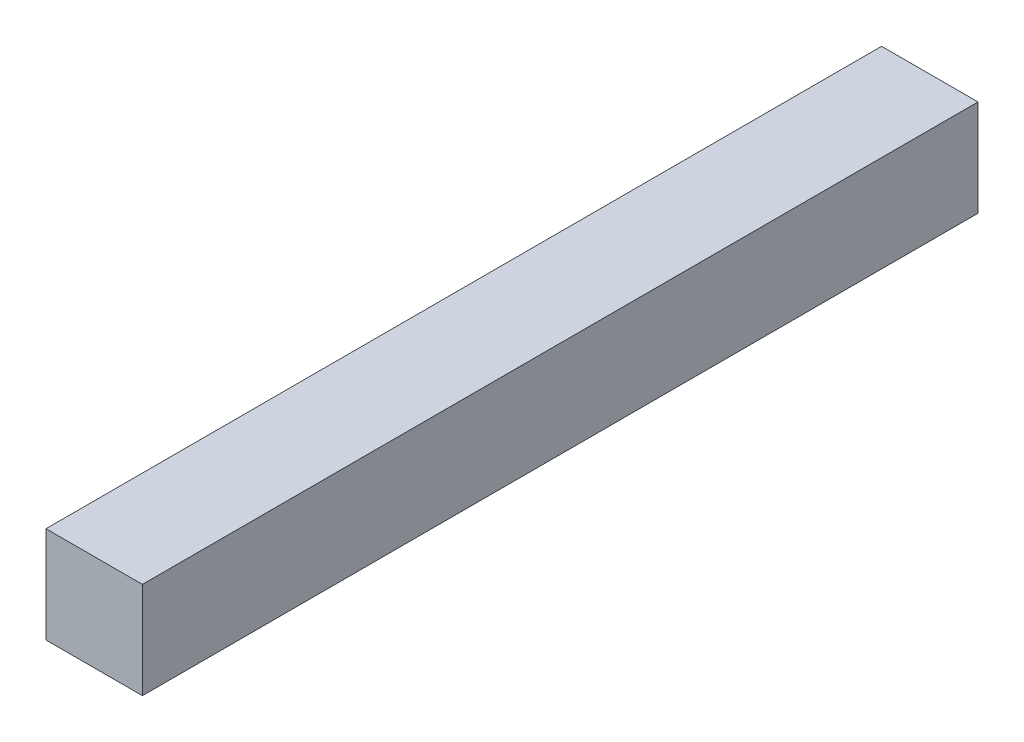
ISO-10303-21;
HEADER;
FILE_DESCRIPTION(('STEP AP214'),'2;1');
FILE_NAME('part.step','',(''),(''),'','','');
FILE_SCHEMA(('AUTOMOTIVE_DESIGN { 1 0 10303 214 1 1 1 1 }'));
ENDSEC;
DATA;
#1=APPLICATION_CONTEXT('core data for automotive mechanical design processes');
#2=APPLICATION_PROTOCOL_DEFINITION('international standard','automotive_design',2000,#1);
#3=PRODUCT_CONTEXT('',#1,'mechanical');
#4=PRODUCT('Part','Part','',(#3));
#5=PRODUCT_RELATED_PRODUCT_CATEGORY('part','',(#4));
#6=PRODUCT_DEFINITION_FORMATION('','',#4);
#7=PRODUCT_DEFINITION_CONTEXT('part definition',#1,'design');
#8=PRODUCT_DEFINITION('design','',#6,#7);
#9=PRODUCT_DEFINITION_SHAPE('','',#8);
#10=(LENGTH_UNIT() NAMED_UNIT(*) SI_UNIT(.MILLI.,.METRE.));
#11=(NAMED_UNIT(*) PLANE_ANGLE_UNIT() SI_UNIT($,.RADIAN.));
#12=(NAMED_UNIT(*) SI_UNIT($,.STERADIAN.) SOLID_ANGLE_UNIT());
#13=UNCERTAINTY_MEASURE_WITH_UNIT(LENGTH_MEASURE(1.E-05),#10,'distance_accuracy_value','');
#14=(GEOMETRIC_REPRESENTATION_CONTEXT(3) GLOBAL_UNCERTAINTY_ASSIGNED_CONTEXT((#13)) GLOBAL_UNIT_ASSIGNED_CONTEXT((#10,
#11,#12)) REPRESENTATION_CONTEXT('',''));
#15=CARTESIAN_POINT('',(0.,0.,0.));
#16=DIRECTION('',(0.,0.,1.));
#17=DIRECTION('',(1.,0.,0.));
#18=AXIS2_PLACEMENT_3D('',#15,#16,#17);
#19=CARTESIAN_POINT('',(-0.75,-0.75,13.));
#20=DIRECTION('',(1.,0.,0.));
#21=DIRECTION('',(0.,0.,-1.));
#22=AXIS2_PLACEMENT_3D('',#19,#20,#21);
#23=PLANE('',#22);
#24=DIRECTION('',(0.,-1.,0.));
#25=VECTOR('',#24,1.);
#26=CARTESIAN_POINT('',(-0.75,-0.75,0.));
#27=LINE('',#26,#25);
#28=CARTESIAN_POINT('',(-0.75,0.75,0.));
#29=VERTEX_POINT('',#28);
#30=CARTESIAN_POINT('',(-0.75,-0.75,0.));
#31=VERTEX_POINT('',#30);
#32=EDGE_CURVE('E96',#29,#31,#27,.T.);
#33=ORIENTED_EDGE('',*,*,#32,.T.);
#34=DIRECTION('',(0.,0.,-1.));
#35=VECTOR('',#34,1.);
#36=CARTESIAN_POINT('',(-0.75,-0.75,13.));
#37=LINE('',#36,#35);
#38=CARTESIAN_POINT('',(-0.75,-0.75,13.));
#39=VERTEX_POINT('',#38);
#40=EDGE_CURVE('E11',#39,#31,#37,.T.);
#41=ORIENTED_EDGE('',*,*,#40,.F.);
#42=DIRECTION('',(0.,-1.,0.));
#43=VECTOR('',#42,1.);
#44=CARTESIAN_POINT('',(-0.75,-0.75,13.));
#45=LINE('',#44,#43);
#46=CARTESIAN_POINT('',(-0.75,0.75,13.));
#47=VERTEX_POINT('',#46);
#48=EDGE_CURVE('E84',#47,#39,#45,.T.);
#49=ORIENTED_EDGE('',*,*,#48,.F.);
#50=DIRECTION('',(0.,0.,-1.));
#51=VECTOR('',#50,1.);
#52=CARTESIAN_POINT('',(-0.75,0.75,13.));
#53=LINE('',#52,#51);
#54=EDGE_CURVE('E92',#47,#29,#53,.T.);
#55=ORIENTED_EDGE('',*,*,#54,.T.);
#56=EDGE_LOOP('',(#33,#41,#49,#55));
#57=FACE_BOUND('',#56,.T.);
#58=ADVANCED_FACE('F33',(#57),#23,.F.);
#59=CARTESIAN_POINT('',(0.75,-0.75,13.));
#60=DIRECTION('',(0.,1.,0.));
#61=DIRECTION('',(-1.,0.,0.));
#62=AXIS2_PLACEMENT_3D('',#59,#60,#61);
#63=PLANE('',#62);
#64=DIRECTION('',(1.,0.,0.));
#65=VECTOR('',#64,1.);
#66=CARTESIAN_POINT('',(0.75,-0.75,0.));
#67=LINE('',#66,#65);
#68=CARTESIAN_POINT('',(0.75,-0.75,0.));
#69=VERTEX_POINT('',#68);
#70=EDGE_CURVE('E88',#31,#69,#67,.T.);
#71=ORIENTED_EDGE('',*,*,#70,.T.);
#72=DIRECTION('',(0.,0.,-1.));
#73=VECTOR('',#72,1.);
#74=CARTESIAN_POINT('',(0.75,-0.75,13.));
#75=LINE('',#74,#73);
#76=CARTESIAN_POINT('',(0.75,-0.75,13.));
#77=VERTEX_POINT('',#76);
#78=EDGE_CURVE('E41',#77,#69,#75,.T.);
#79=ORIENTED_EDGE('',*,*,#78,.F.);
#80=DIRECTION('',(1.,0.,0.));
#81=VECTOR('',#80,1.);
#82=CARTESIAN_POINT('',(0.75,-0.75,13.));
#83=LINE('',#82,#81);
#84=EDGE_CURVE('E79',#39,#77,#83,.T.);
#85=ORIENTED_EDGE('',*,*,#84,.F.);
#86=ORIENTED_EDGE('',*,*,#40,.T.);
#87=EDGE_LOOP('',(#71,#79,#85,#86));
#88=FACE_BOUND('',#87,.T.);
#89=ADVANCED_FACE('F87',(#88),#63,.F.);
#90=CARTESIAN_POINT('',(0.75,-0.75,13.));
#91=DIRECTION('',(-1.,0.,0.));
#92=DIRECTION('',(0.,0.,1.));
#93=AXIS2_PLACEMENT_3D('',#90,#91,#92);
#94=PLANE('',#93);
#95=DIRECTION('',(0.,1.,0.));
#96=VECTOR('',#95,1.);
#97=CARTESIAN_POINT('',(0.75,-0.75,0.));
#98=LINE('',#97,#96);
#99=CARTESIAN_POINT('',(0.75,0.75,0.));
#100=VERTEX_POINT('',#99);
#101=EDGE_CURVE('E66',#69,#100,#98,.T.);
#102=ORIENTED_EDGE('',*,*,#101,.T.);
#103=DIRECTION('',(0.,0.,-1.));
#104=VECTOR('',#103,1.);
#105=CARTESIAN_POINT('',(0.75,0.75,13.));
#106=LINE('',#105,#104);
#107=CARTESIAN_POINT('',(0.75,0.75,13.));
#108=VERTEX_POINT('',#107);
#109=EDGE_CURVE('E89',#108,#100,#106,.T.);
#110=ORIENTED_EDGE('',*,*,#109,.F.);
#111=DIRECTION('',(0.,1.,0.));
#112=VECTOR('',#111,1.);
#113=CARTESIAN_POINT('',(0.75,-0.75,13.));
#114=LINE('',#113,#112);
#115=EDGE_CURVE('E82',#77,#108,#114,.T.);
#116=ORIENTED_EDGE('',*,*,#115,.F.);
#117=ORIENTED_EDGE('',*,*,#78,.T.);
#118=EDGE_LOOP('',(#102,#110,#116,#117));
#119=FACE_BOUND('',#118,.T.);
#120=ADVANCED_FACE('F90',(#119),#94,.F.);
#121=CARTESIAN_POINT('',(0.75,0.75,13.));
#122=DIRECTION('',(0.,-1.,0.));
#123=DIRECTION('',(1.,0.,0.));
#124=AXIS2_PLACEMENT_3D('',#121,#122,#123);
#125=PLANE('',#124);
#126=DIRECTION('',(-1.,0.,0.));
#127=VECTOR('',#126,1.);
#128=CARTESIAN_POINT('',(0.75,0.75,0.));
#129=LINE('',#128,#127);
#130=EDGE_CURVE('E72',#100,#29,#129,.T.);
#131=ORIENTED_EDGE('',*,*,#130,.T.);
#132=ORIENTED_EDGE('',*,*,#54,.F.);
#133=DIRECTION('',(-1.,0.,0.));
#134=VECTOR('',#133,1.);
#135=CARTESIAN_POINT('',(0.75,0.75,13.));
#136=LINE('',#135,#134);
#137=EDGE_CURVE('E49',#108,#47,#136,.T.);
#138=ORIENTED_EDGE('',*,*,#137,.F.);
#139=ORIENTED_EDGE('',*,*,#109,.T.);
#140=EDGE_LOOP('',(#131,#132,#138,#139));
#141=FACE_BOUND('',#140,.T.);
#142=ADVANCED_FACE('F103',(#141),#125,.F.);
#143=CARTESIAN_POINT('',(0.,0.,13.));
#144=DIRECTION('',(0.,0.,1.));
#145=DIRECTION('',(1.,0.,0.));
#146=AXIS2_PLACEMENT_3D('',#143,#144,#145);
#147=PLANE('',#146);
#148=ORIENTED_EDGE('',*,*,#48,.T.);
#149=ORIENTED_EDGE('',*,*,#84,.T.);
#150=ORIENTED_EDGE('',*,*,#115,.T.);
#151=ORIENTED_EDGE('',*,*,#137,.T.);
#152=EDGE_LOOP('',(#148,#149,#150,#151));
#153=FACE_BOUND('',#152,.T.);
#154=ADVANCED_FACE('F80',(#153),#147,.T.);
#155=CARTESIAN_POINT('',(0.,0.,0.));
#156=DIRECTION('',(0.,0.,1.));
#157=DIRECTION('',(1.,0.,0.));
#158=AXIS2_PLACEMENT_3D('',#155,#156,#157);
#159=PLANE('',#158);
#160=ORIENTED_EDGE('',*,*,#32,.F.);
#161=ORIENTED_EDGE('',*,*,#130,.F.);
#162=ORIENTED_EDGE('',*,*,#101,.F.);
#163=ORIENTED_EDGE('',*,*,#70,.F.);
#164=EDGE_LOOP('',(#160,#161,#162,#163));
#165=FACE_BOUND('',#164,.T.);
#166=ADVANCED_FACE('F106',(#165),#159,.F.);
#167=CLOSED_SHELL('',(#58,#89,#120,#142,#154,#166));
#168=MANIFOLD_SOLID_BREP('B2',#167);
#169=ADVANCED_BREP_SHAPE_REPRESENTATION('',(#18,#168),#14);
#170=SHAPE_DEFINITION_REPRESENTATION(#9,#169);
ENDSEC;
END-ISO-10303-21;
